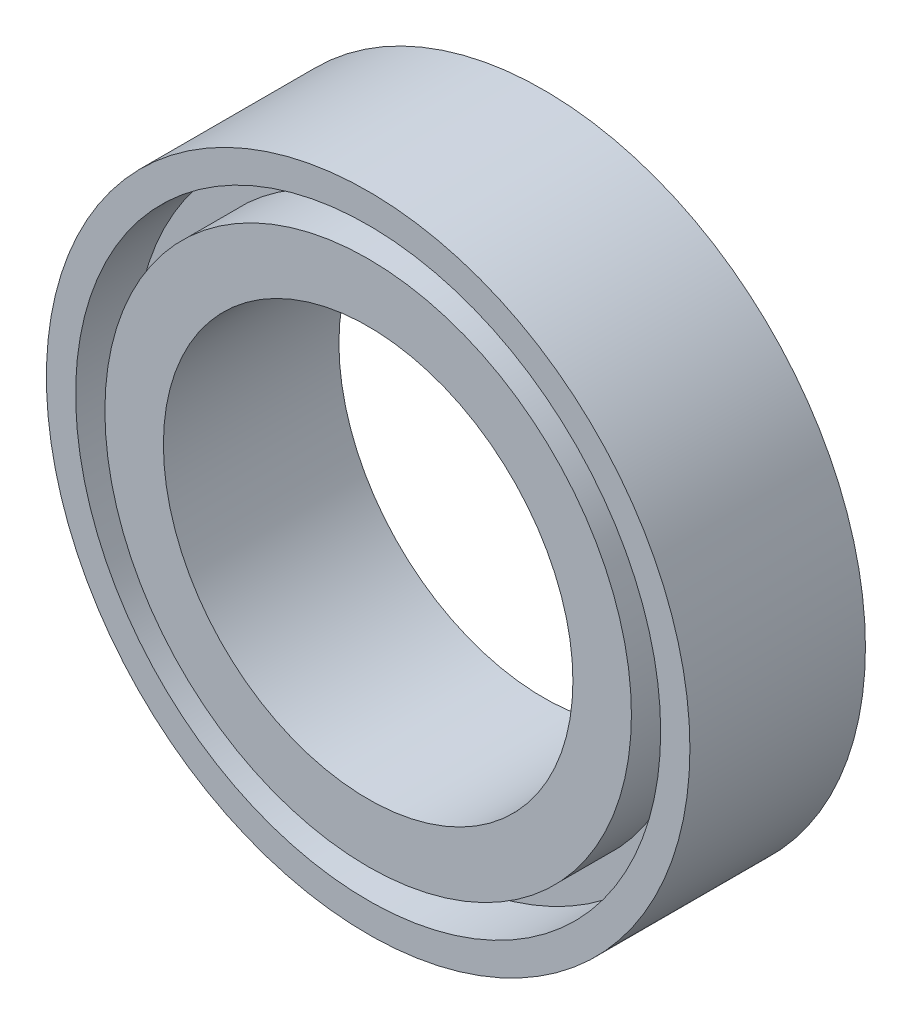
ISO-10303-21;
HEADER;
FILE_DESCRIPTION(('STEP AP214'),'2;1');
FILE_NAME('part.step','',(''),(''),'','','');
FILE_SCHEMA(('AUTOMOTIVE_DESIGN { 1 0 10303 214 1 1 1 1 }'));
ENDSEC;
DATA;
#1=APPLICATION_CONTEXT('core data for automotive mechanical design processes');
#2=APPLICATION_PROTOCOL_DEFINITION('international standard','automotive_design',2000,#1);
#3=PRODUCT_CONTEXT('',#1,'mechanical');
#4=PRODUCT('Part','Part','',(#3));
#5=PRODUCT_RELATED_PRODUCT_CATEGORY('part','',(#4));
#6=PRODUCT_DEFINITION_FORMATION('','',#4);
#7=PRODUCT_DEFINITION_CONTEXT('part definition',#1,'design');
#8=PRODUCT_DEFINITION('design','',#6,#7);
#9=PRODUCT_DEFINITION_SHAPE('','',#8);
#10=(LENGTH_UNIT() NAMED_UNIT(*) SI_UNIT(.MILLI.,.METRE.));
#11=(NAMED_UNIT(*) PLANE_ANGLE_UNIT() SI_UNIT($,.RADIAN.));
#12=(NAMED_UNIT(*) SI_UNIT($,.STERADIAN.) SOLID_ANGLE_UNIT());
#13=UNCERTAINTY_MEASURE_WITH_UNIT(LENGTH_MEASURE(1.E-05),#10,'distance_accuracy_value','');
#14=(GEOMETRIC_REPRESENTATION_CONTEXT(3) GLOBAL_UNCERTAINTY_ASSIGNED_CONTEXT((#13)) GLOBAL_UNIT_ASSIGNED_CONTEXT((#10,
#11,#12)) REPRESENTATION_CONTEXT('',''));
#15=CARTESIAN_POINT('',(0.,0.,0.));
#16=DIRECTION('',(0.,0.,1.));
#17=DIRECTION('',(1.,0.,0.));
#18=AXIS2_PLACEMENT_3D('',#15,#16,#17);
#19=CARTESIAN_POINT('',(0.,0.,0.));
#20=DIRECTION('',(0.,0.,1.));
#21=DIRECTION('',(1.,0.,0.));
#22=AXIS2_PLACEMENT_3D('',#19,#20,#21);
#23=PLANE('',#22);
#24=CARTESIAN_POINT('',(0.,0.,0.));
#25=DIRECTION('',(0.,0.,1.));
#26=DIRECTION('',(1.,0.,0.));
#27=AXIS2_PLACEMENT_3D('',#24,#25,#26);
#28=CIRCLE('',#27,3.5);
#29=CARTESIAN_POINT('',(3.5,0.,0.));
#30=VERTEX_POINT('',#29);
#31=EDGE_CURVE('E49',#30,#30,#28,.T.);
#32=ORIENTED_EDGE('',*,*,#31,.T.);
#33=EDGE_LOOP('',(#32));
#34=FACE_BOUND('',#33,.T.);
#35=CARTESIAN_POINT('',(0.,0.,0.));
#36=DIRECTION('',(0.,0.,-1.));
#37=DIRECTION('',(-1.,0.,0.));
#38=AXIS2_PLACEMENT_3D('',#35,#36,#37);
#39=CIRCLE('',#38,4.5);
#40=CARTESIAN_POINT('',(-4.5,0.,0.));
#41=VERTEX_POINT('',#40);
#42=EDGE_CURVE('E73',#41,#41,#39,.T.);
#43=ORIENTED_EDGE('',*,*,#42,.T.);
#44=EDGE_LOOP('',(#43));
#45=FACE_BOUND('',#44,.T.);
#46=ADVANCED_FACE('F36',(#34,#45),#23,.F.);
#47=CARTESIAN_POINT('',(0.,0.,3.));
#48=DIRECTION('',(0.,0.,1.));
#49=DIRECTION('',(1.,0.,0.));
#50=AXIS2_PLACEMENT_3D('',#47,#48,#49);
#51=PLANE('',#50);
#52=CARTESIAN_POINT('',(0.,0.,3.));
#53=DIRECTION('',(0.,0.,1.));
#54=DIRECTION('',(1.,0.,0.));
#55=AXIS2_PLACEMENT_3D('',#52,#53,#54);
#56=CIRCLE('',#55,3.5);
#57=CARTESIAN_POINT('',(3.5,0.,3.));
#58=VERTEX_POINT('',#57);
#59=EDGE_CURVE('E47',#58,#58,#56,.T.);
#60=ORIENTED_EDGE('',*,*,#59,.F.);
#61=EDGE_LOOP('',(#60));
#62=FACE_BOUND('',#61,.T.);
#63=CARTESIAN_POINT('',(0.,0.,3.));
#64=DIRECTION('',(0.,0.,1.));
#65=DIRECTION('',(1.,0.,0.));
#66=AXIS2_PLACEMENT_3D('',#63,#64,#65);
#67=CIRCLE('',#66,4.5);
#68=CARTESIAN_POINT('',(4.5,0.,3.));
#69=VERTEX_POINT('',#68);
#70=EDGE_CURVE('E61',#69,#69,#67,.T.);
#71=ORIENTED_EDGE('',*,*,#70,.T.);
#72=EDGE_LOOP('',(#71));
#73=FACE_BOUND('',#72,.T.);
#74=ADVANCED_FACE('F111',(#62,#73),#51,.T.);
#75=CARTESIAN_POINT('',(0.,0.,3.));
#76=DIRECTION('',(0.,0.,1.));
#77=DIRECTION('',(1.,0.,0.));
#78=AXIS2_PLACEMENT_3D('',#75,#76,#77);
#79=CIRCLE('',#78,5.);
#80=CARTESIAN_POINT('',(5.,0.,3.));
#81=VERTEX_POINT('',#80);
#82=EDGE_CURVE('E55',#81,#81,#79,.T.);
#83=ORIENTED_EDGE('',*,*,#82,.F.);
#84=EDGE_LOOP('',(#83));
#85=FACE_BOUND('',#84,.T.);
#86=CARTESIAN_POINT('',(0.,0.,3.));
#87=DIRECTION('',(0.,0.,1.));
#88=DIRECTION('',(1.,0.,0.));
#89=AXIS2_PLACEMENT_3D('',#86,#87,#88);
#90=CIRCLE('',#89,5.5);
#91=CARTESIAN_POINT('',(5.5,0.,3.));
#92=VERTEX_POINT('',#91);
#93=EDGE_CURVE('E10',#92,#92,#90,.T.);
#94=ORIENTED_EDGE('',*,*,#93,.T.);
#95=EDGE_LOOP('',(#94));
#96=FACE_BOUND('',#95,.T.);
#97=ADVANCED_FACE('F98',(#85,#96),#51,.T.);
#98=CARTESIAN_POINT('',(0.,0.,0.));
#99=DIRECTION('',(0.,0.,-1.));
#100=DIRECTION('',(-1.,0.,0.));
#101=AXIS2_PLACEMENT_3D('',#98,#99,#100);
#102=CIRCLE('',#101,5.);
#103=CARTESIAN_POINT('',(-5.,0.,0.));
#104=VERTEX_POINT('',#103);
#105=EDGE_CURVE('E67',#104,#104,#102,.T.);
#106=ORIENTED_EDGE('',*,*,#105,.F.);
#107=EDGE_LOOP('',(#106));
#108=FACE_BOUND('',#107,.T.);
#109=CARTESIAN_POINT('',(0.,0.,0.));
#110=DIRECTION('',(0.,0.,1.));
#111=DIRECTION('',(1.,0.,0.));
#112=AXIS2_PLACEMENT_3D('',#109,#110,#111);
#113=CIRCLE('',#112,5.5);
#114=CARTESIAN_POINT('',(5.5,0.,0.));
#115=VERTEX_POINT('',#114);
#116=EDGE_CURVE('E40',#115,#115,#113,.T.);
#117=ORIENTED_EDGE('',*,*,#116,.F.);
#118=EDGE_LOOP('',(#117));
#119=FACE_BOUND('',#118,.T.);
#120=ADVANCED_FACE('F95',(#108,#119),#23,.F.);
#121=CARTESIAN_POINT('',(0.,0.,3.));
#122=DIRECTION('',(0.,0.,-1.));
#123=DIRECTION('',(-1.,0.,0.));
#124=AXIS2_PLACEMENT_3D('',#121,#122,#123);
#125=CYLINDRICAL_SURFACE('',#124,5.5);
#126=ORIENTED_EDGE('',*,*,#93,.F.);
#127=EDGE_LOOP('',(#126));
#128=FACE_BOUND('',#127,.T.);
#129=ORIENTED_EDGE('',*,*,#116,.T.);
#130=EDGE_LOOP('',(#129));
#131=FACE_BOUND('',#130,.T.);
#132=ADVANCED_FACE('F38',(#128,#131),#125,.T.);
#133=CARTESIAN_POINT('',(0.,0.,3.));
#134=DIRECTION('',(0.,0.,-1.));
#135=DIRECTION('',(-1.,0.,0.));
#136=AXIS2_PLACEMENT_3D('',#133,#134,#135);
#137=CYLINDRICAL_SURFACE('',#136,3.5);
#138=ORIENTED_EDGE('',*,*,#59,.T.);
#139=EDGE_LOOP('',(#138));
#140=FACE_BOUND('',#139,.T.);
#141=ORIENTED_EDGE('',*,*,#31,.F.);
#142=EDGE_LOOP('',(#141));
#143=FACE_BOUND('',#142,.T.);
#144=ADVANCED_FACE('F102',(#140,#143),#137,.F.);
#145=CARTESIAN_POINT('',(0.,0.,2.));
#146=DIRECTION('',(0.,0.,1.));
#147=DIRECTION('',(1.,0.,0.));
#148=AXIS2_PLACEMENT_3D('',#145,#146,#147);
#149=CYLINDRICAL_SURFACE('',#148,5.);
#150=CARTESIAN_POINT('',(0.,0.,2.));
#151=DIRECTION('',(0.,0.,1.));
#152=DIRECTION('',(1.,0.,0.));
#153=AXIS2_PLACEMENT_3D('',#150,#151,#152);
#154=CIRCLE('',#153,5.);
#155=CARTESIAN_POINT('',(5.,0.,2.));
#156=VERTEX_POINT('',#155);
#157=EDGE_CURVE('E52',#156,#156,#154,.T.);
#158=ORIENTED_EDGE('',*,*,#157,.F.);
#159=EDGE_LOOP('',(#158));
#160=FACE_BOUND('',#159,.T.);
#161=ORIENTED_EDGE('',*,*,#82,.T.);
#162=EDGE_LOOP('',(#161));
#163=FACE_BOUND('',#162,.T.);
#164=ADVANCED_FACE('F107',(#160,#163),#149,.F.);
#165=CARTESIAN_POINT('',(0.,0.,2.));
#166=DIRECTION('',(0.,0.,1.));
#167=DIRECTION('',(1.,0.,0.));
#168=AXIS2_PLACEMENT_3D('',#165,#166,#167);
#169=PLANE('',#168);
#170=CARTESIAN_POINT('',(0.,0.,2.));
#171=DIRECTION('',(0.,0.,1.));
#172=DIRECTION('',(1.,0.,0.));
#173=AXIS2_PLACEMENT_3D('',#170,#171,#172);
#174=CIRCLE('',#173,4.5);
#175=CARTESIAN_POINT('',(4.5,0.,2.));
#176=VERTEX_POINT('',#175);
#177=EDGE_CURVE('E58',#176,#176,#174,.T.);
#178=ORIENTED_EDGE('',*,*,#177,.F.);
#179=EDGE_LOOP('',(#178));
#180=FACE_BOUND('',#179,.T.);
#181=ORIENTED_EDGE('',*,*,#157,.T.);
#182=EDGE_LOOP('',(#181));
#183=FACE_BOUND('',#182,.T.);
#184=ADVANCED_FACE('F124',(#180,#183),#169,.T.);
#185=CARTESIAN_POINT('',(0.,0.,2.));
#186=DIRECTION('',(0.,0.,1.));
#187=DIRECTION('',(1.,0.,0.));
#188=AXIS2_PLACEMENT_3D('',#185,#186,#187);
#189=CYLINDRICAL_SURFACE('',#188,4.5);
#190=ORIENTED_EDGE('',*,*,#177,.T.);
#191=EDGE_LOOP('',(#190));
#192=FACE_BOUND('',#191,.T.);
#193=ORIENTED_EDGE('',*,*,#70,.F.);
#194=EDGE_LOOP('',(#193));
#195=FACE_BOUND('',#194,.T.);
#196=ADVANCED_FACE('F91',(#192,#195),#189,.T.);
#197=CARTESIAN_POINT('',(0.,0.,1.));
#198=DIRECTION('',(0.,0.,-1.));
#199=DIRECTION('',(-1.,0.,0.));
#200=AXIS2_PLACEMENT_3D('',#197,#198,#199);
#201=CYLINDRICAL_SURFACE('',#200,5.);
#202=CARTESIAN_POINT('',(0.,0.,1.));
#203=DIRECTION('',(0.,0.,-1.));
#204=DIRECTION('',(-1.,0.,0.));
#205=AXIS2_PLACEMENT_3D('',#202,#203,#204);
#206=CIRCLE('',#205,5.);
#207=CARTESIAN_POINT('',(-5.,0.,1.));
#208=VERTEX_POINT('',#207);
#209=EDGE_CURVE('E64',#208,#208,#206,.T.);
#210=ORIENTED_EDGE('',*,*,#209,.F.);
#211=EDGE_LOOP('',(#210));
#212=FACE_BOUND('',#211,.T.);
#213=ORIENTED_EDGE('',*,*,#105,.T.);
#214=EDGE_LOOP('',(#213));
#215=FACE_BOUND('',#214,.T.);
#216=ADVANCED_FACE('F85',(#212,#215),#201,.F.);
#217=CARTESIAN_POINT('',(0.,0.,1.));
#218=DIRECTION('',(0.,0.,-1.));
#219=DIRECTION('',(-1.,0.,0.));
#220=AXIS2_PLACEMENT_3D('',#217,#218,#219);
#221=PLANE('',#220);
#222=CARTESIAN_POINT('',(0.,0.,1.));
#223=DIRECTION('',(0.,0.,-1.));
#224=DIRECTION('',(-1.,0.,0.));
#225=AXIS2_PLACEMENT_3D('',#222,#223,#224);
#226=CIRCLE('',#225,4.5);
#227=CARTESIAN_POINT('',(-4.5,0.,1.));
#228=VERTEX_POINT('',#227);
#229=EDGE_CURVE('E70',#228,#228,#226,.T.);
#230=ORIENTED_EDGE('',*,*,#229,.F.);
#231=EDGE_LOOP('',(#230));
#232=FACE_BOUND('',#231,.T.);
#233=ORIENTED_EDGE('',*,*,#209,.T.);
#234=EDGE_LOOP('',(#233));
#235=FACE_BOUND('',#234,.T.);
#236=ADVANCED_FACE('F82',(#232,#235),#221,.T.);
#237=CARTESIAN_POINT('',(0.,0.,1.));
#238=DIRECTION('',(0.,0.,-1.));
#239=DIRECTION('',(-1.,0.,0.));
#240=AXIS2_PLACEMENT_3D('',#237,#238,#239);
#241=CYLINDRICAL_SURFACE('',#240,4.5);
#242=ORIENTED_EDGE('',*,*,#229,.T.);
#243=EDGE_LOOP('',(#242));
#244=FACE_BOUND('',#243,.T.);
#245=ORIENTED_EDGE('',*,*,#42,.F.);
#246=EDGE_LOOP('',(#245));
#247=FACE_BOUND('',#246,.T.);
#248=ADVANCED_FACE('F79',(#244,#247),#241,.T.);
#249=CLOSED_SHELL('',(#46,#74,#97,#120,#132,#144,#164,#184,#196,#216,#236,#248));
#250=MANIFOLD_SOLID_BREP('B2',#249);
#251=ADVANCED_BREP_SHAPE_REPRESENTATION('',(#18,#250),#14);
#252=SHAPE_DEFINITION_REPRESENTATION(#9,#251);
ENDSEC;
END-ISO-10303-21;
